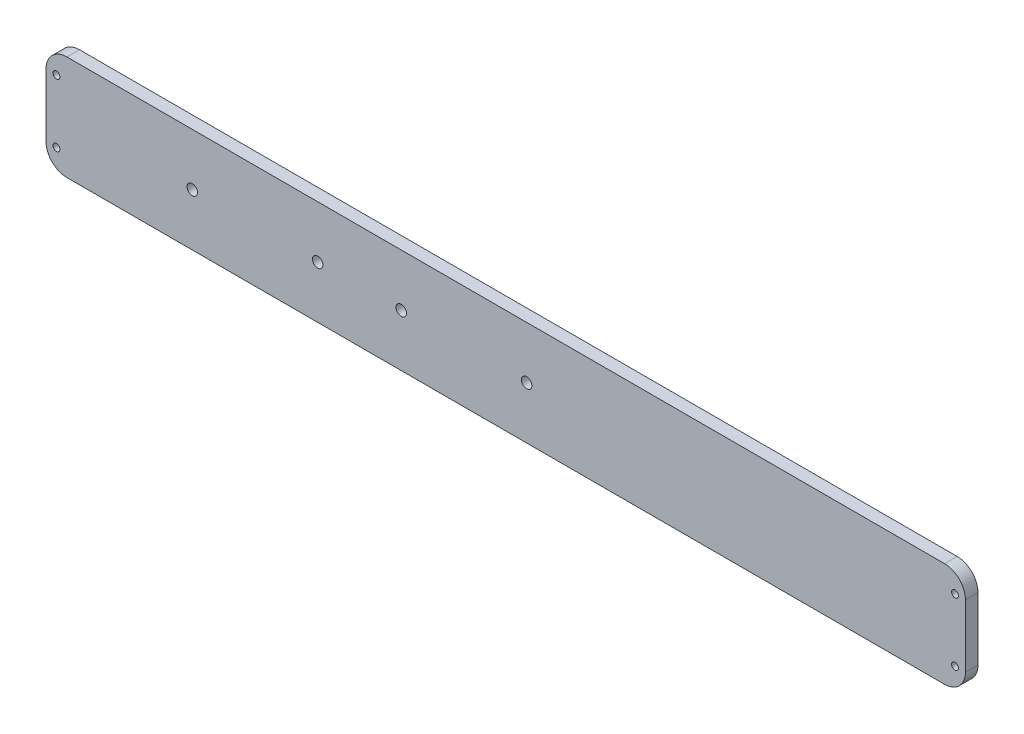
ISO-10303-21;
HEADER;
FILE_DESCRIPTION(('STEP AP214'),'2;1');
FILE_NAME('part.step','',(''),(''),'','','');
FILE_SCHEMA(('AUTOMOTIVE_DESIGN { 1 0 10303 214 1 1 1 1 }'));
ENDSEC;
DATA;
#1=APPLICATION_CONTEXT('core data for automotive mechanical design processes');
#2=APPLICATION_PROTOCOL_DEFINITION('international standard','automotive_design',2000,#1);
#3=PRODUCT_CONTEXT('',#1,'mechanical');
#4=PRODUCT('Part','Part','',(#3));
#5=PRODUCT_RELATED_PRODUCT_CATEGORY('part','',(#4));
#6=PRODUCT_DEFINITION_FORMATION('','',#4);
#7=PRODUCT_DEFINITION_CONTEXT('part definition',#1,'design');
#8=PRODUCT_DEFINITION('design','',#6,#7);
#9=PRODUCT_DEFINITION_SHAPE('','',#8);
#10=(LENGTH_UNIT() NAMED_UNIT(*) SI_UNIT(.MILLI.,.METRE.));
#11=(NAMED_UNIT(*) PLANE_ANGLE_UNIT() SI_UNIT($,.RADIAN.));
#12=(NAMED_UNIT(*) SI_UNIT($,.STERADIAN.) SOLID_ANGLE_UNIT());
#13=UNCERTAINTY_MEASURE_WITH_UNIT(LENGTH_MEASURE(1.E-05),#10,'distance_accuracy_value','');
#14=(GEOMETRIC_REPRESENTATION_CONTEXT(3) GLOBAL_UNCERTAINTY_ASSIGNED_CONTEXT((#13)) GLOBAL_UNIT_ASSIGNED_CONTEXT((#10,
#11,#12)) REPRESENTATION_CONTEXT('',''));
#15=CARTESIAN_POINT('',(0.,0.,0.));
#16=DIRECTION('',(0.,0.,1.));
#17=DIRECTION('',(1.,0.,0.));
#18=AXIS2_PLACEMENT_3D('',#15,#16,#17);
#19=CARTESIAN_POINT('',(210.,15.,6.));
#20=DIRECTION('',(0.,0.,-1.));
#21=DIRECTION('',(-1.,0.,0.));
#22=AXIS2_PLACEMENT_3D('',#19,#20,#21);
#23=CYLINDRICAL_SURFACE('',#22,10.);
#24=CARTESIAN_POINT('',(210.,15.,0.));
#25=DIRECTION('',(0.,0.,1.));
#26=DIRECTION('',(1.,0.,0.));
#27=AXIS2_PLACEMENT_3D('',#24,#25,#26);
#28=CIRCLE('',#27,10.);
#29=CARTESIAN_POINT('',(220.,15.,0.));
#30=VERTEX_POINT('',#29);
#31=CARTESIAN_POINT('',(210.,25.,0.));
#32=VERTEX_POINT('',#31);
#33=EDGE_CURVE('E129',#30,#32,#28,.T.);
#34=ORIENTED_EDGE('',*,*,#33,.T.);
#35=DIRECTION('',(0.,0.,-1.));
#36=VECTOR('',#35,1.);
#37=CARTESIAN_POINT('',(210.,25.,6.));
#38=LINE('',#37,#36);
#39=CARTESIAN_POINT('',(210.,25.,6.));
#40=VERTEX_POINT('',#39);
#41=EDGE_CURVE('E11',#40,#32,#38,.T.);
#42=ORIENTED_EDGE('',*,*,#41,.F.);
#43=CARTESIAN_POINT('',(210.,15.,6.));
#44=DIRECTION('',(0.,0.,1.));
#45=DIRECTION('',(1.,0.,0.));
#46=AXIS2_PLACEMENT_3D('',#43,#44,#45);
#47=CIRCLE('',#46,10.);
#48=CARTESIAN_POINT('',(220.,15.,6.));
#49=VERTEX_POINT('',#48);
#50=EDGE_CURVE('E144',#49,#40,#47,.T.);
#51=ORIENTED_EDGE('',*,*,#50,.F.);
#52=DIRECTION('',(0.,0.,-1.));
#53=VECTOR('',#52,1.);
#54=CARTESIAN_POINT('',(220.,15.,6.));
#55=LINE('',#54,#53);
#56=EDGE_CURVE('E125',#49,#30,#55,.T.);
#57=ORIENTED_EDGE('',*,*,#56,.T.);
#58=EDGE_LOOP('',(#34,#42,#51,#57));
#59=FACE_BOUND('',#58,.T.);
#60=ADVANCED_FACE('F33',(#59),#23,.T.);
#61=CARTESIAN_POINT('',(210.,25.,6.));
#62=DIRECTION('',(0.,-1.,0.));
#63=DIRECTION('',(1.,0.,0.));
#64=AXIS2_PLACEMENT_3D('',#61,#62,#63);
#65=PLANE('',#64);
#66=DIRECTION('',(-1.,0.,0.));
#67=VECTOR('',#66,1.);
#68=CARTESIAN_POINT('',(210.,25.,0.));
#69=LINE('',#68,#67);
#70=CARTESIAN_POINT('',(-210.,25.,0.));
#71=VERTEX_POINT('',#70);
#72=EDGE_CURVE('E132',#32,#71,#69,.T.);
#73=ORIENTED_EDGE('',*,*,#72,.T.);
#74=DIRECTION('',(0.,0.,-1.));
#75=VECTOR('',#74,1.);
#76=CARTESIAN_POINT('',(-210.,25.,6.));
#77=LINE('',#76,#75);
#78=CARTESIAN_POINT('',(-210.,25.,6.));
#79=VERTEX_POINT('',#78);
#80=EDGE_CURVE('E41',#79,#71,#77,.T.);
#81=ORIENTED_EDGE('',*,*,#80,.F.);
#82=DIRECTION('',(-1.,0.,0.));
#83=VECTOR('',#82,1.);
#84=CARTESIAN_POINT('',(210.,25.,6.));
#85=LINE('',#84,#83);
#86=EDGE_CURVE('E92',#40,#79,#85,.T.);
#87=ORIENTED_EDGE('',*,*,#86,.F.);
#88=ORIENTED_EDGE('',*,*,#41,.T.);
#89=EDGE_LOOP('',(#73,#81,#87,#88));
#90=FACE_BOUND('',#89,.T.);
#91=ADVANCED_FACE('F267',(#90),#65,.F.);
#92=CARTESIAN_POINT('',(-210.,15.,6.));
#93=DIRECTION('',(0.,0.,-1.));
#94=DIRECTION('',(-1.,0.,0.));
#95=AXIS2_PLACEMENT_3D('',#92,#93,#94);
#96=CYLINDRICAL_SURFACE('',#95,10.);
#97=CARTESIAN_POINT('',(-210.,15.,0.));
#98=DIRECTION('',(0.,0.,1.));
#99=DIRECTION('',(1.,0.,0.));
#100=AXIS2_PLACEMENT_3D('',#97,#98,#99);
#101=CIRCLE('',#100,10.);
#102=CARTESIAN_POINT('',(-220.,14.9999999999999,0.));
#103=VERTEX_POINT('',#102);
#104=EDGE_CURVE('E135',#71,#103,#101,.T.);
#105=ORIENTED_EDGE('',*,*,#104,.T.);
#106=DIRECTION('',(0.,0.,-1.));
#107=VECTOR('',#106,1.);
#108=CARTESIAN_POINT('',(-220.,14.9999999999999,6.));
#109=LINE('',#108,#107);
#110=CARTESIAN_POINT('',(-220.,14.9999999999999,6.));
#111=VERTEX_POINT('',#110);
#112=EDGE_CURVE('E151',#111,#103,#109,.T.);
#113=ORIENTED_EDGE('',*,*,#112,.F.);
#114=CARTESIAN_POINT('',(-210.,15.,6.));
#115=DIRECTION('',(0.,0.,1.));
#116=DIRECTION('',(1.,0.,0.));
#117=AXIS2_PLACEMENT_3D('',#114,#115,#116);
#118=CIRCLE('',#117,10.);
#119=EDGE_CURVE('E159',#79,#111,#118,.T.);
#120=ORIENTED_EDGE('',*,*,#119,.F.);
#121=ORIENTED_EDGE('',*,*,#80,.T.);
#122=EDGE_LOOP('',(#105,#113,#120,#121));
#123=FACE_BOUND('',#122,.T.);
#124=ADVANCED_FACE('F157',(#123),#96,.T.);
#125=CARTESIAN_POINT('',(-220.,-15.,6.));
#126=DIRECTION('',(1.,0.,0.));
#127=DIRECTION('',(0.,0.,-1.));
#128=AXIS2_PLACEMENT_3D('',#125,#126,#127);
#129=PLANE('',#128);
#130=DIRECTION('',(0.,-1.,0.));
#131=VECTOR('',#130,1.);
#132=CARTESIAN_POINT('',(-220.,-15.,0.));
#133=LINE('',#132,#131);
#134=CARTESIAN_POINT('',(-220.,-15.,0.));
#135=VERTEX_POINT('',#134);
#136=EDGE_CURVE('E137',#103,#135,#133,.T.);
#137=ORIENTED_EDGE('',*,*,#136,.T.);
#138=DIRECTION('',(0.,0.,-1.));
#139=VECTOR('',#138,1.);
#140=CARTESIAN_POINT('',(-220.,-15.,6.));
#141=LINE('',#140,#139);
#142=CARTESIAN_POINT('',(-220.,-15.,6.));
#143=VERTEX_POINT('',#142);
#144=EDGE_CURVE('E148',#143,#135,#141,.T.);
#145=ORIENTED_EDGE('',*,*,#144,.F.);
#146=DIRECTION('',(0.,-1.,0.));
#147=VECTOR('',#146,1.);
#148=CARTESIAN_POINT('',(-220.,-15.,6.));
#149=LINE('',#148,#147);
#150=EDGE_CURVE('E171',#111,#143,#149,.T.);
#151=ORIENTED_EDGE('',*,*,#150,.F.);
#152=ORIENTED_EDGE('',*,*,#112,.T.);
#153=EDGE_LOOP('',(#137,#145,#151,#152));
#154=FACE_BOUND('',#153,.T.);
#155=ADVANCED_FACE('F167',(#154),#129,.F.);
#156=CARTESIAN_POINT('',(-210.,-15.,6.));
#157=DIRECTION('',(0.,0.,-1.));
#158=DIRECTION('',(-1.,0.,0.));
#159=AXIS2_PLACEMENT_3D('',#156,#157,#158);
#160=CYLINDRICAL_SURFACE('',#159,10.);
#161=CARTESIAN_POINT('',(-210.,-15.,0.));
#162=DIRECTION('',(0.,0.,1.));
#163=DIRECTION('',(-1.,0.,0.));
#164=AXIS2_PLACEMENT_3D('',#161,#162,#163);
#165=CIRCLE('',#164,10.);
#166=CARTESIAN_POINT('',(-210.,-25.,0.));
#167=VERTEX_POINT('',#166);
#168=EDGE_CURVE('E139',#135,#167,#165,.T.);
#169=ORIENTED_EDGE('',*,*,#168,.T.);
#170=DIRECTION('',(0.,0.,-1.));
#171=VECTOR('',#170,1.);
#172=CARTESIAN_POINT('',(-210.,-25.,6.));
#173=LINE('',#172,#171);
#174=CARTESIAN_POINT('',(-210.,-25.,6.));
#175=VERTEX_POINT('',#174);
#176=EDGE_CURVE('E120',#175,#167,#173,.T.);
#177=ORIENTED_EDGE('',*,*,#176,.F.);
#178=CARTESIAN_POINT('',(-210.,-15.,6.));
#179=DIRECTION('',(0.,0.,1.));
#180=DIRECTION('',(-1.,0.,0.));
#181=AXIS2_PLACEMENT_3D('',#178,#179,#180);
#182=CIRCLE('',#181,10.);
#183=EDGE_CURVE('E111',#143,#175,#182,.T.);
#184=ORIENTED_EDGE('',*,*,#183,.F.);
#185=ORIENTED_EDGE('',*,*,#144,.T.);
#186=EDGE_LOOP('',(#169,#177,#184,#185));
#187=FACE_BOUND('',#186,.T.);
#188=ADVANCED_FACE('F170',(#187),#160,.T.);
#189=CARTESIAN_POINT('',(210.,-25.,6.));
#190=DIRECTION('',(0.,1.,0.));
#191=DIRECTION('',(-1.,0.,0.));
#192=AXIS2_PLACEMENT_3D('',#189,#190,#191);
#193=PLANE('',#192);
#194=DIRECTION('',(1.,0.,0.));
#195=VECTOR('',#194,1.);
#196=CARTESIAN_POINT('',(210.,-25.,0.));
#197=LINE('',#196,#195);
#198=CARTESIAN_POINT('',(210.,-25.,0.));
#199=VERTEX_POINT('',#198);
#200=EDGE_CURVE('E119',#167,#199,#197,.T.);
#201=ORIENTED_EDGE('',*,*,#200,.T.);
#202=DIRECTION('',(0.,0.,-1.));
#203=VECTOR('',#202,1.);
#204=CARTESIAN_POINT('',(210.,-25.,6.));
#205=LINE('',#204,#203);
#206=CARTESIAN_POINT('',(210.,-25.,6.));
#207=VERTEX_POINT('',#206);
#208=EDGE_CURVE('E116',#207,#199,#205,.T.);
#209=ORIENTED_EDGE('',*,*,#208,.F.);
#210=DIRECTION('',(1.,0.,0.));
#211=VECTOR('',#210,1.);
#212=CARTESIAN_POINT('',(210.,-25.,6.));
#213=LINE('',#212,#211);
#214=EDGE_CURVE('E105',#175,#207,#213,.T.);
#215=ORIENTED_EDGE('',*,*,#214,.F.);
#216=ORIENTED_EDGE('',*,*,#176,.T.);
#217=EDGE_LOOP('',(#201,#209,#215,#216));
#218=FACE_BOUND('',#217,.T.);
#219=ADVANCED_FACE('F117',(#218),#193,.F.);
#220=CARTESIAN_POINT('',(210.,-15.,6.));
#221=DIRECTION('',(0.,0.,-1.));
#222=DIRECTION('',(-1.,0.,0.));
#223=AXIS2_PLACEMENT_3D('',#220,#221,#222);
#224=CYLINDRICAL_SURFACE('',#223,10.);
#225=CARTESIAN_POINT('',(210.,-15.,0.));
#226=DIRECTION('',(0.,0.,1.));
#227=DIRECTION('',(1.,0.,0.));
#228=AXIS2_PLACEMENT_3D('',#225,#226,#227);
#229=CIRCLE('',#228,10.);
#230=CARTESIAN_POINT('',(220.,-14.9999999999999,0.));
#231=VERTEX_POINT('',#230);
#232=EDGE_CURVE('E78',#199,#231,#229,.T.);
#233=ORIENTED_EDGE('',*,*,#232,.T.);
#234=DIRECTION('',(0.,0.,-1.));
#235=VECTOR('',#234,1.);
#236=CARTESIAN_POINT('',(220.,-14.9999999999999,6.));
#237=LINE('',#236,#235);
#238=CARTESIAN_POINT('',(220.,-14.9999999999999,6.));
#239=VERTEX_POINT('',#238);
#240=EDGE_CURVE('E121',#239,#231,#237,.T.);
#241=ORIENTED_EDGE('',*,*,#240,.F.);
#242=CARTESIAN_POINT('',(210.,-15.,6.));
#243=DIRECTION('',(0.,0.,1.));
#244=DIRECTION('',(1.,0.,0.));
#245=AXIS2_PLACEMENT_3D('',#242,#243,#244);
#246=CIRCLE('',#245,10.);
#247=EDGE_CURVE('E109',#207,#239,#246,.T.);
#248=ORIENTED_EDGE('',*,*,#247,.F.);
#249=ORIENTED_EDGE('',*,*,#208,.T.);
#250=EDGE_LOOP('',(#233,#241,#248,#249));
#251=FACE_BOUND('',#250,.T.);
#252=ADVANCED_FACE('F123',(#251),#224,.T.);
#253=CARTESIAN_POINT('',(220.,-14.9999999999999,6.));
#254=DIRECTION('',(-1.,0.,0.));
#255=DIRECTION('',(0.,0.,1.));
#256=AXIS2_PLACEMENT_3D('',#253,#254,#255);
#257=PLANE('',#256);
#258=DIRECTION('',(0.,1.,0.));
#259=VECTOR('',#258,1.);
#260=CARTESIAN_POINT('',(220.,-14.9999999999999,0.));
#261=LINE('',#260,#259);
#262=EDGE_CURVE('E84',#231,#30,#261,.T.);
#263=ORIENTED_EDGE('',*,*,#262,.T.);
#264=ORIENTED_EDGE('',*,*,#56,.F.);
#265=DIRECTION('',(0.,1.,0.));
#266=VECTOR('',#265,1.);
#267=CARTESIAN_POINT('',(220.,-14.9999999999999,6.));
#268=LINE('',#267,#266);
#269=EDGE_CURVE('E49',#239,#49,#268,.T.);
#270=ORIENTED_EDGE('',*,*,#269,.F.);
#271=ORIENTED_EDGE('',*,*,#240,.T.);
#272=EDGE_LOOP('',(#263,#264,#270,#271));
#273=FACE_BOUND('',#272,.T.);
#274=ADVANCED_FACE('F236',(#273),#257,.F.);
#275=CARTESIAN_POINT('',(210.,15.,6.));
#276=DIRECTION('',(0.,0.,1.));
#277=DIRECTION('',(1.,0.,0.));
#278=AXIS2_PLACEMENT_3D('',#275,#276,#277);
#279=PLANE('',#278);
#280=CARTESIAN_POINT('',(9.99999999999998,0.,6.));
#281=DIRECTION('',(0.,0.,1.));
#282=DIRECTION('',(1.,0.,0.));
#283=AXIS2_PLACEMENT_3D('',#280,#281,#282);
#284=CIRCLE('',#283,2.5);
#285=CARTESIAN_POINT('',(12.5,0.,6.));
#286=VERTEX_POINT('',#285);
#287=EDGE_CURVE('E219',#286,#286,#284,.T.);
#288=ORIENTED_EDGE('',*,*,#287,.F.);
#289=EDGE_LOOP('',(#288));
#290=FACE_BOUND('',#289,.T.);
#291=CARTESIAN_POINT('',(-50.,0.,6.));
#292=DIRECTION('',(0.,0.,1.));
#293=DIRECTION('',(1.,0.,0.));
#294=AXIS2_PLACEMENT_3D('',#291,#292,#293);
#295=CIRCLE('',#294,2.5);
#296=CARTESIAN_POINT('',(-47.5,0.,6.));
#297=VERTEX_POINT('',#296);
#298=EDGE_CURVE('E213',#297,#297,#295,.T.);
#299=ORIENTED_EDGE('',*,*,#298,.F.);
#300=EDGE_LOOP('',(#299));
#301=FACE_BOUND('',#300,.T.);
#302=CARTESIAN_POINT('',(-90.,0.,6.));
#303=DIRECTION('',(0.,0.,1.));
#304=DIRECTION('',(1.,0.,0.));
#305=AXIS2_PLACEMENT_3D('',#302,#303,#304);
#306=CIRCLE('',#305,2.5);
#307=CARTESIAN_POINT('',(-87.5,0.,6.));
#308=VERTEX_POINT('',#307);
#309=EDGE_CURVE('E207',#308,#308,#306,.T.);
#310=ORIENTED_EDGE('',*,*,#309,.F.);
#311=EDGE_LOOP('',(#310));
#312=FACE_BOUND('',#311,.T.);
#313=CARTESIAN_POINT('',(-150.,0.,6.));
#314=DIRECTION('',(0.,0.,1.));
#315=DIRECTION('',(1.,0.,0.));
#316=AXIS2_PLACEMENT_3D('',#313,#314,#315);
#317=CIRCLE('',#316,2.5);
#318=CARTESIAN_POINT('',(-147.5,0.,6.));
#319=VERTEX_POINT('',#318);
#320=EDGE_CURVE('E201',#319,#319,#317,.T.);
#321=ORIENTED_EDGE('',*,*,#320,.F.);
#322=EDGE_LOOP('',(#321));
#323=FACE_BOUND('',#322,.T.);
#324=CARTESIAN_POINT('',(-215.,-15.,6.));
#325=DIRECTION('',(0.,0.,1.));
#326=DIRECTION('',(1.,0.,0.));
#327=AXIS2_PLACEMENT_3D('',#324,#325,#326);
#328=CIRCLE('',#327,1.65000000000002);
#329=CARTESIAN_POINT('',(-213.35,-15.,6.));
#330=VERTEX_POINT('',#329);
#331=EDGE_CURVE('E195',#330,#330,#328,.T.);
#332=ORIENTED_EDGE('',*,*,#331,.F.);
#333=EDGE_LOOP('',(#332));
#334=FACE_BOUND('',#333,.T.);
#335=CARTESIAN_POINT('',(-215.,15.,6.));
#336=DIRECTION('',(0.,0.,1.));
#337=DIRECTION('',(1.,0.,0.));
#338=AXIS2_PLACEMENT_3D('',#335,#336,#337);
#339=CIRCLE('',#338,1.65000000000002);
#340=CARTESIAN_POINT('',(-213.35,15.,6.));
#341=VERTEX_POINT('',#340);
#342=EDGE_CURVE('E189',#341,#341,#339,.T.);
#343=ORIENTED_EDGE('',*,*,#342,.F.);
#344=EDGE_LOOP('',(#343));
#345=FACE_BOUND('',#344,.T.);
#346=CARTESIAN_POINT('',(215.,-15.,6.));
#347=DIRECTION('',(0.,0.,1.));
#348=DIRECTION('',(1.,0.,0.));
#349=AXIS2_PLACEMENT_3D('',#346,#347,#348);
#350=CIRCLE('',#349,1.65000000000002);
#351=CARTESIAN_POINT('',(216.65,-15.,6.));
#352=VERTEX_POINT('',#351);
#353=EDGE_CURVE('E183',#352,#352,#350,.T.);
#354=ORIENTED_EDGE('',*,*,#353,.F.);
#355=EDGE_LOOP('',(#354));
#356=FACE_BOUND('',#355,.T.);
#357=CARTESIAN_POINT('',(215.,15.,6.));
#358=DIRECTION('',(0.,0.,1.));
#359=DIRECTION('',(1.,0.,0.));
#360=AXIS2_PLACEMENT_3D('',#357,#358,#359);
#361=CIRCLE('',#360,1.65000000000002);
#362=CARTESIAN_POINT('',(216.65,15.,6.));
#363=VERTEX_POINT('',#362);
#364=EDGE_CURVE('E177',#363,#363,#361,.T.);
#365=ORIENTED_EDGE('',*,*,#364,.F.);
#366=EDGE_LOOP('',(#365));
#367=FACE_BOUND('',#366,.T.);
#368=ORIENTED_EDGE('',*,*,#50,.T.);
#369=ORIENTED_EDGE('',*,*,#86,.T.);
#370=ORIENTED_EDGE('',*,*,#119,.T.);
#371=ORIENTED_EDGE('',*,*,#150,.T.);
#372=ORIENTED_EDGE('',*,*,#183,.T.);
#373=ORIENTED_EDGE('',*,*,#214,.T.);
#374=ORIENTED_EDGE('',*,*,#247,.T.);
#375=ORIENTED_EDGE('',*,*,#269,.T.);
#376=EDGE_LOOP('',(#368,#369,#370,#371,#372,#373,#374,#375));
#377=FACE_BOUND('',#376,.T.);
#378=ADVANCED_FACE('F107',(#290,#301,#312,#323,#334,#345,#356,#367,#377),#279,.T.);
#379=CARTESIAN_POINT('',(210.,15.,0.));
#380=DIRECTION('',(0.,0.,1.));
#381=DIRECTION('',(1.,0.,0.));
#382=AXIS2_PLACEMENT_3D('',#379,#380,#381);
#383=PLANE('',#382);
#384=CARTESIAN_POINT('',(9.99999999999998,0.,0.));
#385=DIRECTION('',(0.,0.,1.));
#386=DIRECTION('',(1.,0.,0.));
#387=AXIS2_PLACEMENT_3D('',#384,#385,#386);
#388=CIRCLE('',#387,2.5);
#389=CARTESIAN_POINT('',(12.5,0.,0.));
#390=VERTEX_POINT('',#389);
#391=EDGE_CURVE('E216',#390,#390,#388,.T.);
#392=ORIENTED_EDGE('',*,*,#391,.T.);
#393=EDGE_LOOP('',(#392));
#394=FACE_BOUND('',#393,.T.);
#395=CARTESIAN_POINT('',(-50.,0.,0.));
#396=DIRECTION('',(0.,0.,1.));
#397=DIRECTION('',(1.,0.,0.));
#398=AXIS2_PLACEMENT_3D('',#395,#396,#397);
#399=CIRCLE('',#398,2.5);
#400=CARTESIAN_POINT('',(-47.5,0.,0.));
#401=VERTEX_POINT('',#400);
#402=EDGE_CURVE('E210',#401,#401,#399,.T.);
#403=ORIENTED_EDGE('',*,*,#402,.T.);
#404=EDGE_LOOP('',(#403));
#405=FACE_BOUND('',#404,.T.);
#406=CARTESIAN_POINT('',(-90.,0.,0.));
#407=DIRECTION('',(0.,0.,1.));
#408=DIRECTION('',(1.,0.,0.));
#409=AXIS2_PLACEMENT_3D('',#406,#407,#408);
#410=CIRCLE('',#409,2.5);
#411=CARTESIAN_POINT('',(-87.5,0.,0.));
#412=VERTEX_POINT('',#411);
#413=EDGE_CURVE('E204',#412,#412,#410,.T.);
#414=ORIENTED_EDGE('',*,*,#413,.T.);
#415=EDGE_LOOP('',(#414));
#416=FACE_BOUND('',#415,.T.);
#417=CARTESIAN_POINT('',(-150.,0.,0.));
#418=DIRECTION('',(0.,0.,1.));
#419=DIRECTION('',(1.,0.,0.));
#420=AXIS2_PLACEMENT_3D('',#417,#418,#419);
#421=CIRCLE('',#420,2.5);
#422=CARTESIAN_POINT('',(-147.5,0.,0.));
#423=VERTEX_POINT('',#422);
#424=EDGE_CURVE('E198',#423,#423,#421,.T.);
#425=ORIENTED_EDGE('',*,*,#424,.T.);
#426=EDGE_LOOP('',(#425));
#427=FACE_BOUND('',#426,.T.);
#428=CARTESIAN_POINT('',(-215.,-15.,0.));
#429=DIRECTION('',(0.,0.,1.));
#430=DIRECTION('',(1.,0.,0.));
#431=AXIS2_PLACEMENT_3D('',#428,#429,#430);
#432=CIRCLE('',#431,1.65000000000002);
#433=CARTESIAN_POINT('',(-213.35,-15.,0.));
#434=VERTEX_POINT('',#433);
#435=EDGE_CURVE('E192',#434,#434,#432,.T.);
#436=ORIENTED_EDGE('',*,*,#435,.T.);
#437=EDGE_LOOP('',(#436));
#438=FACE_BOUND('',#437,.T.);
#439=CARTESIAN_POINT('',(-215.,15.,0.));
#440=DIRECTION('',(0.,0.,1.));
#441=DIRECTION('',(1.,0.,0.));
#442=AXIS2_PLACEMENT_3D('',#439,#440,#441);
#443=CIRCLE('',#442,1.65000000000002);
#444=CARTESIAN_POINT('',(-213.35,15.,0.));
#445=VERTEX_POINT('',#444);
#446=EDGE_CURVE('E186',#445,#445,#443,.T.);
#447=ORIENTED_EDGE('',*,*,#446,.T.);
#448=EDGE_LOOP('',(#447));
#449=FACE_BOUND('',#448,.T.);
#450=CARTESIAN_POINT('',(215.,-15.,0.));
#451=DIRECTION('',(0.,0.,1.));
#452=DIRECTION('',(1.,0.,0.));
#453=AXIS2_PLACEMENT_3D('',#450,#451,#452);
#454=CIRCLE('',#453,1.65000000000002);
#455=CARTESIAN_POINT('',(216.65,-15.,0.));
#456=VERTEX_POINT('',#455);
#457=EDGE_CURVE('E180',#456,#456,#454,.T.);
#458=ORIENTED_EDGE('',*,*,#457,.T.);
#459=EDGE_LOOP('',(#458));
#460=FACE_BOUND('',#459,.T.);
#461=CARTESIAN_POINT('',(215.,15.,0.));
#462=DIRECTION('',(0.,0.,1.));
#463=DIRECTION('',(1.,0.,0.));
#464=AXIS2_PLACEMENT_3D('',#461,#462,#463);
#465=CIRCLE('',#464,1.65000000000002);
#466=CARTESIAN_POINT('',(216.65,15.,0.));
#467=VERTEX_POINT('',#466);
#468=EDGE_CURVE('E133',#467,#467,#465,.T.);
#469=ORIENTED_EDGE('',*,*,#468,.T.);
#470=EDGE_LOOP('',(#469));
#471=FACE_BOUND('',#470,.T.);
#472=ORIENTED_EDGE('',*,*,#33,.F.);
#473=ORIENTED_EDGE('',*,*,#262,.F.);
#474=ORIENTED_EDGE('',*,*,#232,.F.);
#475=ORIENTED_EDGE('',*,*,#200,.F.);
#476=ORIENTED_EDGE('',*,*,#168,.F.);
#477=ORIENTED_EDGE('',*,*,#136,.F.);
#478=ORIENTED_EDGE('',*,*,#104,.F.);
#479=ORIENTED_EDGE('',*,*,#72,.F.);
#480=EDGE_LOOP('',(#472,#473,#474,#475,#476,#477,#478,#479));
#481=FACE_BOUND('',#480,.T.);
#482=ADVANCED_FACE('F163',(#394,#405,#416,#427,#438,#449,#460,#471,#481),#383,.F.);
#483=CARTESIAN_POINT('',(215.,15.,0.));
#484=DIRECTION('',(0.,0.,1.));
#485=DIRECTION('',(1.,0.,0.));
#486=AXIS2_PLACEMENT_3D('',#483,#484,#485);
#487=CYLINDRICAL_SURFACE('',#486,1.65000000000002);
#488=ORIENTED_EDGE('',*,*,#468,.F.);
#489=EDGE_LOOP('',(#488));
#490=FACE_BOUND('',#489,.T.);
#491=ORIENTED_EDGE('',*,*,#364,.T.);
#492=EDGE_LOOP('',(#491));
#493=FACE_BOUND('',#492,.T.);
#494=ADVANCED_FACE('F252',(#490,#493),#487,.F.);
#495=CARTESIAN_POINT('',(215.,-15.,0.));
#496=DIRECTION('',(0.,0.,1.));
#497=DIRECTION('',(1.,0.,0.));
#498=AXIS2_PLACEMENT_3D('',#495,#496,#497);
#499=CYLINDRICAL_SURFACE('',#498,1.65000000000002);
#500=ORIENTED_EDGE('',*,*,#457,.F.);
#501=EDGE_LOOP('',(#500));
#502=FACE_BOUND('',#501,.T.);
#503=ORIENTED_EDGE('',*,*,#353,.T.);
#504=EDGE_LOOP('',(#503));
#505=FACE_BOUND('',#504,.T.);
#506=ADVANCED_FACE('F254',(#502,#505),#499,.F.);
#507=CARTESIAN_POINT('',(-215.,15.,0.));
#508=DIRECTION('',(0.,0.,1.));
#509=DIRECTION('',(1.,0.,0.));
#510=AXIS2_PLACEMENT_3D('',#507,#508,#509);
#511=CYLINDRICAL_SURFACE('',#510,1.65000000000002);
#512=ORIENTED_EDGE('',*,*,#446,.F.);
#513=EDGE_LOOP('',(#512));
#514=FACE_BOUND('',#513,.T.);
#515=ORIENTED_EDGE('',*,*,#342,.T.);
#516=EDGE_LOOP('',(#515));
#517=FACE_BOUND('',#516,.T.);
#518=ADVANCED_FACE('F261',(#514,#517),#511,.F.);
#519=CARTESIAN_POINT('',(-215.,-15.,0.));
#520=DIRECTION('',(0.,0.,1.));
#521=DIRECTION('',(1.,0.,0.));
#522=AXIS2_PLACEMENT_3D('',#519,#520,#521);
#523=CYLINDRICAL_SURFACE('',#522,1.65000000000002);
#524=ORIENTED_EDGE('',*,*,#435,.F.);
#525=EDGE_LOOP('',(#524));
#526=FACE_BOUND('',#525,.T.);
#527=ORIENTED_EDGE('',*,*,#331,.T.);
#528=EDGE_LOOP('',(#527));
#529=FACE_BOUND('',#528,.T.);
#530=ADVANCED_FACE('F343',(#526,#529),#523,.F.);
#531=CARTESIAN_POINT('',(-150.,0.,0.));
#532=DIRECTION('',(0.,0.,1.));
#533=DIRECTION('',(1.,0.,0.));
#534=AXIS2_PLACEMENT_3D('',#531,#532,#533);
#535=CYLINDRICAL_SURFACE('',#534,2.5);
#536=ORIENTED_EDGE('',*,*,#424,.F.);
#537=EDGE_LOOP('',(#536));
#538=FACE_BOUND('',#537,.T.);
#539=ORIENTED_EDGE('',*,*,#320,.T.);
#540=EDGE_LOOP('',(#539));
#541=FACE_BOUND('',#540,.T.);
#542=ADVANCED_FACE('F353',(#538,#541),#535,.F.);
#543=CARTESIAN_POINT('',(-90.,0.,0.));
#544=DIRECTION('',(0.,0.,1.));
#545=DIRECTION('',(1.,0.,0.));
#546=AXIS2_PLACEMENT_3D('',#543,#544,#545);
#547=CYLINDRICAL_SURFACE('',#546,2.5);
#548=ORIENTED_EDGE('',*,*,#413,.F.);
#549=EDGE_LOOP('',(#548));
#550=FACE_BOUND('',#549,.T.);
#551=ORIENTED_EDGE('',*,*,#309,.T.);
#552=EDGE_LOOP('',(#551));
#553=FACE_BOUND('',#552,.T.);
#554=ADVANCED_FACE('F363',(#550,#553),#547,.F.);
#555=CARTESIAN_POINT('',(-50.,0.,0.));
#556=DIRECTION('',(0.,0.,1.));
#557=DIRECTION('',(1.,0.,0.));
#558=AXIS2_PLACEMENT_3D('',#555,#556,#557);
#559=CYLINDRICAL_SURFACE('',#558,2.5);
#560=ORIENTED_EDGE('',*,*,#402,.F.);
#561=EDGE_LOOP('',(#560));
#562=FACE_BOUND('',#561,.T.);
#563=ORIENTED_EDGE('',*,*,#298,.T.);
#564=EDGE_LOOP('',(#563));
#565=FACE_BOUND('',#564,.T.);
#566=ADVANCED_FACE('F230',(#562,#565),#559,.F.);
#567=CARTESIAN_POINT('',(9.99999999999998,0.,0.));
#568=DIRECTION('',(0.,0.,1.));
#569=DIRECTION('',(1.,0.,0.));
#570=AXIS2_PLACEMENT_3D('',#567,#568,#569);
#571=CYLINDRICAL_SURFACE('',#570,2.5);
#572=ORIENTED_EDGE('',*,*,#391,.F.);
#573=EDGE_LOOP('',(#572));
#574=FACE_BOUND('',#573,.T.);
#575=ORIENTED_EDGE('',*,*,#287,.T.);
#576=EDGE_LOOP('',(#575));
#577=FACE_BOUND('',#576,.T.);
#578=ADVANCED_FACE('F227',(#574,#577),#571,.F.);
#579=CLOSED_SHELL('',(#60,#91,#124,#155,#188,#219,#252,#274,#378,#482,#494,#506,#518,#530,#542,
#554,#566,#578));
#580=MANIFOLD_SOLID_BREP('B2',#579);
#581=ADVANCED_BREP_SHAPE_REPRESENTATION('',(#18,#580),#14);
#582=SHAPE_DEFINITION_REPRESENTATION(#9,#581);
ENDSEC;
END-ISO-10303-21;
